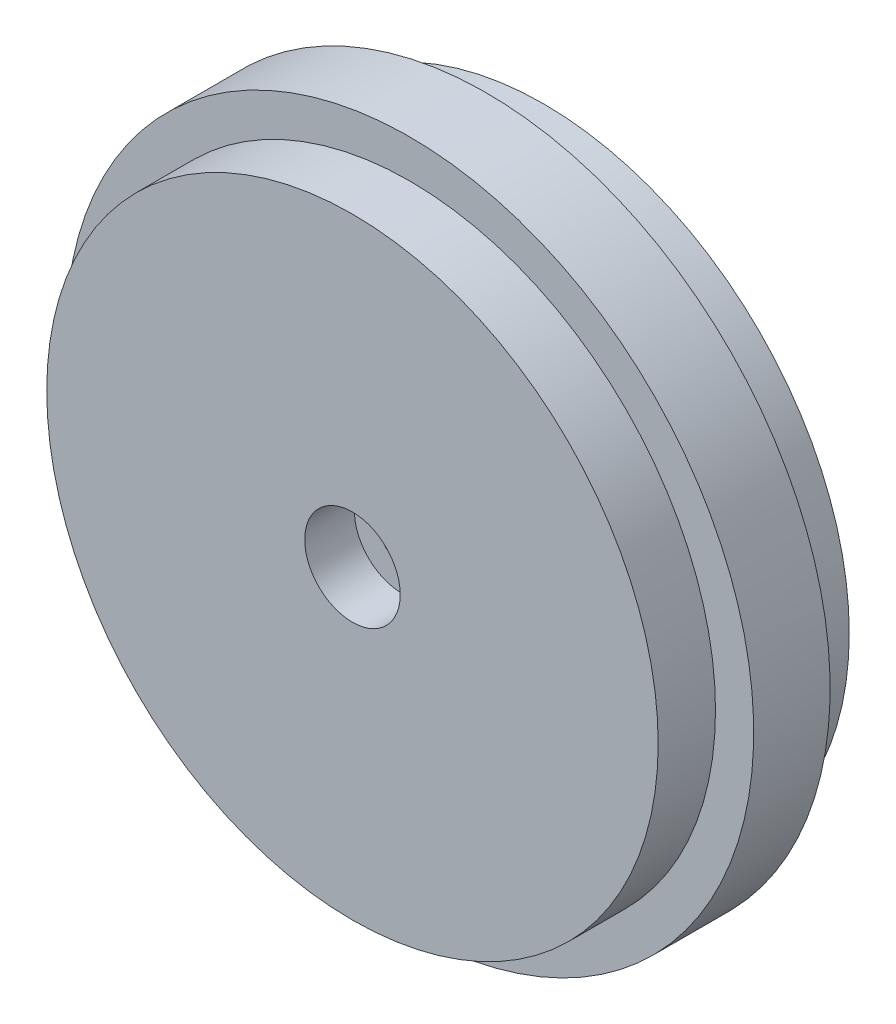
ISO-10303-21;
HEADER;
FILE_DESCRIPTION(('STEP AP214'),'2;1');
FILE_NAME('part.step','',(''),(''),'','','');
FILE_SCHEMA(('AUTOMOTIVE_DESIGN { 1 0 10303 214 1 1 1 1 }'));
ENDSEC;
DATA;
#1=APPLICATION_CONTEXT('core data for automotive mechanical design processes');
#2=APPLICATION_PROTOCOL_DEFINITION('international standard','automotive_design',2000,#1);
#3=PRODUCT_CONTEXT('',#1,'mechanical');
#4=PRODUCT('Part','Part','',(#3));
#5=PRODUCT_RELATED_PRODUCT_CATEGORY('part','',(#4));
#6=PRODUCT_DEFINITION_FORMATION('','',#4);
#7=PRODUCT_DEFINITION_CONTEXT('part definition',#1,'design');
#8=PRODUCT_DEFINITION('design','',#6,#7);
#9=PRODUCT_DEFINITION_SHAPE('','',#8);
#10=(LENGTH_UNIT() NAMED_UNIT(*) SI_UNIT(.MILLI.,.METRE.));
#11=(NAMED_UNIT(*) PLANE_ANGLE_UNIT() SI_UNIT($,.RADIAN.));
#12=(NAMED_UNIT(*) SI_UNIT($,.STERADIAN.) SOLID_ANGLE_UNIT());
#13=UNCERTAINTY_MEASURE_WITH_UNIT(LENGTH_MEASURE(1.E-05),#10,'distance_accuracy_value','');
#14=(GEOMETRIC_REPRESENTATION_CONTEXT(3) GLOBAL_UNCERTAINTY_ASSIGNED_CONTEXT((#13)) GLOBAL_UNIT_ASSIGNED_CONTEXT((#10,
#11,#12)) REPRESENTATION_CONTEXT('',''));
#15=CARTESIAN_POINT('',(0.,0.,0.));
#16=DIRECTION('',(0.,0.,1.));
#17=DIRECTION('',(1.,0.,0.));
#18=AXIS2_PLACEMENT_3D('',#15,#16,#17);
#19=CARTESIAN_POINT('',(0.,0.,20.));
#20=DIRECTION('',(0.,0.,-1.));
#21=DIRECTION('',(-1.,0.,0.));
#22=AXIS2_PLACEMENT_3D('',#19,#20,#21);
#23=CYLINDRICAL_SURFACE('',#22,16.);
#24=CARTESIAN_POINT('',(0.,0.,10.));
#25=DIRECTION('',(0.,0.,1.));
#26=DIRECTION('',(1.,0.,0.));
#27=AXIS2_PLACEMENT_3D('',#24,#25,#26);
#28=CIRCLE('',#27,16.);
#29=CARTESIAN_POINT('',(16.,0.,10.));
#30=VERTEX_POINT('',#29);
#31=EDGE_CURVE('E114',#30,#30,#28,.T.);
#32=ORIENTED_EDGE('',*,*,#31,.F.);
#33=EDGE_LOOP('',(#32));
#34=FACE_BOUND('',#33,.T.);
#35=CARTESIAN_POINT('',(0.,0.,7.));
#36=DIRECTION('',(0.,0.,-1.));
#37=DIRECTION('',(-1.,0.,0.));
#38=AXIS2_PLACEMENT_3D('',#35,#36,#37);
#39=CIRCLE('',#38,16.);
#40=CARTESIAN_POINT('',(-16.,0.,7.));
#41=VERTEX_POINT('',#40);
#42=EDGE_CURVE('E154',#41,#41,#39,.T.);
#43=ORIENTED_EDGE('',*,*,#42,.F.);
#44=EDGE_LOOP('',(#43));
#45=FACE_BOUND('',#44,.T.);
#46=ADVANCED_FACE('F41',(#34,#45),#23,.T.);
#47=CARTESIAN_POINT('',(0.,0.,0.));
#48=DIRECTION('',(0.,0.,1.));
#49=DIRECTION('',(1.,0.,0.));
#50=AXIS2_PLACEMENT_3D('',#47,#48,#49);
#51=PLANE('',#50);
#52=CARTESIAN_POINT('',(0.,0.,0.));
#53=DIRECTION('',(0.,0.,-1.));
#54=DIRECTION('',(-1.,0.,0.));
#55=AXIS2_PLACEMENT_3D('',#52,#53,#54);
#56=CIRCLE('',#55,13.5);
#57=CARTESIAN_POINT('',(-13.5,0.,0.));
#58=VERTEX_POINT('',#57);
#59=EDGE_CURVE('E123',#58,#58,#56,.T.);
#60=ORIENTED_EDGE('',*,*,#59,.F.);
#61=EDGE_LOOP('',(#60));
#62=FACE_BOUND('',#61,.T.);
#63=CARTESIAN_POINT('',(0.,0.,0.));
#64=DIRECTION('',(0.,0.,-1.));
#65=DIRECTION('',(-1.,0.,0.));
#66=AXIS2_PLACEMENT_3D('',#63,#64,#65);
#67=CIRCLE('',#66,16.);
#68=CARTESIAN_POINT('',(-16.,0.,0.));
#69=VERTEX_POINT('',#68);
#70=EDGE_CURVE('E142',#69,#69,#67,.T.);
#71=ORIENTED_EDGE('',*,*,#70,.T.);
#72=EDGE_LOOP('',(#71));
#73=FACE_BOUND('',#72,.T.);
#74=ADVANCED_FACE('F43',(#62,#73),#51,.F.);
#75=CARTESIAN_POINT('',(0.,0.,10.));
#76=DIRECTION('',(0.,0.,1.));
#77=DIRECTION('',(1.,0.,0.));
#78=AXIS2_PLACEMENT_3D('',#75,#76,#77);
#79=PLANE('',#78);
#80=ORIENTED_EDGE('',*,*,#31,.T.);
#81=EDGE_LOOP('',(#80));
#82=FACE_BOUND('',#81,.T.);
#83=CARTESIAN_POINT('',(0.,0.,10.));
#84=DIRECTION('',(0.,0.,1.));
#85=DIRECTION('',(1.,0.,0.));
#86=AXIS2_PLACEMENT_3D('',#83,#84,#85);
#87=CIRCLE('',#86,2.5);
#88=CARTESIAN_POINT('',(2.5,0.,10.));
#89=VERTEX_POINT('',#88);
#90=EDGE_CURVE('E158',#89,#89,#87,.T.);
#91=ORIENTED_EDGE('',*,*,#90,.F.);
#92=EDGE_LOOP('',(#91));
#93=FACE_BOUND('',#92,.T.);
#94=ADVANCED_FACE('F164',(#82,#93),#79,.T.);
#95=CARTESIAN_POINT('',(0.,0.,9.));
#96=DIRECTION('',(0.,0.,1.));
#97=DIRECTION('',(1.,0.,0.));
#98=AXIS2_PLACEMENT_3D('',#95,#96,#97);
#99=CYLINDRICAL_SURFACE('',#98,1.2);
#100=CARTESIAN_POINT('',(0.,0.,7.4));
#101=DIRECTION('',(0.,0.,1.));
#102=DIRECTION('',(1.,0.,0.));
#103=AXIS2_PLACEMENT_3D('',#100,#101,#102);
#104=CIRCLE('',#103,1.2);
#105=CARTESIAN_POINT('',(1.2,0.,7.4));
#106=VERTEX_POINT('',#105);
#107=EDGE_CURVE('E49',#106,#106,#104,.T.);
#108=ORIENTED_EDGE('',*,*,#107,.T.);
#109=EDGE_LOOP('',(#108));
#110=FACE_BOUND('',#109,.T.);
#111=CARTESIAN_POINT('',(0.,0.,7.));
#112=DIRECTION('',(0.,0.,-1.));
#113=DIRECTION('',(-1.,0.,0.));
#114=AXIS2_PLACEMENT_3D('',#111,#112,#113);
#115=CIRCLE('',#114,1.2);
#116=CARTESIAN_POINT('',(-1.2,0.,7.));
#117=VERTEX_POINT('',#116);
#118=EDGE_CURVE('E120',#117,#117,#115,.F.);
#119=ORIENTED_EDGE('',*,*,#118,.F.);
#120=EDGE_LOOP('',(#119));
#121=FACE_BOUND('',#120,.T.);
#122=ADVANCED_FACE('F166',(#110,#121),#99,.F.);
#123=DIRECTION('',(0.,-1.,0.));
#124=VECTOR('',#123,1.);
#125=CARTESIAN_POINT('',(2.15,2.09224759529077,0.));
#126=LINE('',#125,#124);
#127=CARTESIAN_POINT('',(2.15,2.09224759529077,0.));
#128=VERTEX_POINT('',#127);
#129=CARTESIAN_POINT('',(2.15,-2.09224759529077,0.));
#130=VERTEX_POINT('',#129);
#131=EDGE_CURVE('E91',#128,#130,#126,.T.);
#132=ORIENTED_EDGE('',*,*,#131,.F.);
#133=CARTESIAN_POINT('',(0.,0.,0.));
#134=DIRECTION('',(0.,0.,-1.));
#135=DIRECTION('',(-1.,0.,0.));
#136=AXIS2_PLACEMENT_3D('',#133,#134,#135);
#137=CIRCLE('',#136,3.);
#138=CARTESIAN_POINT('',(-2.15,2.09224759529077,0.));
#139=VERTEX_POINT('',#138);
#140=EDGE_CURVE('E56',#139,#128,#137,.T.);
#141=ORIENTED_EDGE('',*,*,#140,.F.);
#142=DIRECTION('',(0.,1.,0.));
#143=VECTOR('',#142,1.);
#144=CARTESIAN_POINT('',(-2.15,2.09224759529077,0.));
#145=LINE('',#144,#143);
#146=CARTESIAN_POINT('',(-2.15,-2.09224759529077,0.));
#147=VERTEX_POINT('',#146);
#148=EDGE_CURVE('E108',#147,#139,#145,.T.);
#149=ORIENTED_EDGE('',*,*,#148,.F.);
#150=CARTESIAN_POINT('',(0.,0.,0.));
#151=DIRECTION('',(0.,0.,-1.));
#152=DIRECTION('',(-1.,0.,0.));
#153=AXIS2_PLACEMENT_3D('',#150,#151,#152);
#154=CIRCLE('',#153,3.);
#155=EDGE_CURVE('E116',#130,#147,#154,.T.);
#156=ORIENTED_EDGE('',*,*,#155,.F.);
#157=EDGE_LOOP('',(#132,#141,#149,#156));
#158=FACE_BOUND('',#157,.T.);
#159=CARTESIAN_POINT('',(0.,0.,0.));
#160=DIRECTION('',(0.,0.,-1.));
#161=DIRECTION('',(-1.,0.,0.));
#162=AXIS2_PLACEMENT_3D('',#159,#160,#161);
#163=CIRCLE('',#162,4.2);
#164=CARTESIAN_POINT('',(-4.2,0.,0.));
#165=VERTEX_POINT('',#164);
#166=EDGE_CURVE('E127',#165,#165,#163,.T.);
#167=ORIENTED_EDGE('',*,*,#166,.T.);
#168=EDGE_LOOP('',(#167));
#169=FACE_BOUND('',#168,.T.);
#170=ADVANCED_FACE('F171',(#158,#169),#51,.F.);
#171=CARTESIAN_POINT('',(1.2,0.,7.4));
#172=DIRECTION('',(0.,0.,-1.));
#173=DIRECTION('',(-1.,0.,0.));
#174=AXIS2_PLACEMENT_3D('',#171,#172,#173);
#175=PLANE('',#174);
#176=ORIENTED_EDGE('',*,*,#107,.F.);
#177=EDGE_LOOP('',(#176));
#178=FACE_BOUND('',#177,.T.);
#179=CARTESIAN_POINT('',(0.,0.,7.4));
#180=DIRECTION('',(0.,0.,1.));
#181=DIRECTION('',(1.,0.,0.));
#182=AXIS2_PLACEMENT_3D('',#179,#180,#181);
#183=CIRCLE('',#182,2.5);
#184=CARTESIAN_POINT('',(2.5,0.,7.4));
#185=VERTEX_POINT('',#184);
#186=EDGE_CURVE('E133',#185,#185,#183,.T.);
#187=ORIENTED_EDGE('',*,*,#186,.T.);
#188=EDGE_LOOP('',(#187));
#189=FACE_BOUND('',#188,.T.);
#190=ADVANCED_FACE('F284',(#178,#189),#175,.F.);
#191=CARTESIAN_POINT('',(0.,0.,9.));
#192=DIRECTION('',(0.,0.,1.));
#193=DIRECTION('',(1.,0.,0.));
#194=AXIS2_PLACEMENT_3D('',#191,#192,#193);
#195=CYLINDRICAL_SURFACE('',#194,2.5);
#196=ORIENTED_EDGE('',*,*,#186,.F.);
#197=EDGE_LOOP('',(#196));
#198=FACE_BOUND('',#197,.T.);
#199=ORIENTED_EDGE('',*,*,#90,.T.);
#200=EDGE_LOOP('',(#199));
#201=FACE_BOUND('',#200,.T.);
#202=ADVANCED_FACE('F162',(#198,#201),#195,.F.);
#203=CARTESIAN_POINT('',(0.,0.,47.1837661840736));
#204=DIRECTION('',(0.,0.,-1.));
#205=DIRECTION('',(-1.,0.,0.));
#206=AXIS2_PLACEMENT_3D('',#203,#204,#205);
#207=CYLINDRICAL_SURFACE('',#206,13.5);
#208=ORIENTED_EDGE('',*,*,#59,.T.);
#209=EDGE_LOOP('',(#208));
#210=FACE_BOUND('',#209,.T.);
#211=CARTESIAN_POINT('',(0.,0.,7.));
#212=DIRECTION('',(0.,0.,1.));
#213=DIRECTION('',(1.,0.,0.));
#214=AXIS2_PLACEMENT_3D('',#211,#212,#213);
#215=CIRCLE('',#214,13.5);
#216=CARTESIAN_POINT('',(13.5,0.,7.));
#217=VERTEX_POINT('',#216);
#218=EDGE_CURVE('E130',#217,#217,#215,.F.);
#219=ORIENTED_EDGE('',*,*,#218,.F.);
#220=EDGE_LOOP('',(#219));
#221=FACE_BOUND('',#220,.T.);
#222=ADVANCED_FACE('F310',(#210,#221),#207,.F.);
#223=CARTESIAN_POINT('',(0.,0.,47.1837661840736));
#224=DIRECTION('',(0.,0.,-1.));
#225=DIRECTION('',(-1.,0.,0.));
#226=AXIS2_PLACEMENT_3D('',#223,#224,#225);
#227=CYLINDRICAL_SURFACE('',#226,4.2);
#228=ORIENTED_EDGE('',*,*,#166,.F.);
#229=EDGE_LOOP('',(#228));
#230=FACE_BOUND('',#229,.T.);
#231=CARTESIAN_POINT('',(0.,0.,7.));
#232=DIRECTION('',(0.,0.,1.));
#233=DIRECTION('',(1.,0.,0.));
#234=AXIS2_PLACEMENT_3D('',#231,#232,#233);
#235=CIRCLE('',#234,4.2);
#236=CARTESIAN_POINT('',(4.2,0.,7.));
#237=VERTEX_POINT('',#236);
#238=EDGE_CURVE('E126',#237,#237,#235,.F.);
#239=ORIENTED_EDGE('',*,*,#238,.T.);
#240=EDGE_LOOP('',(#239));
#241=FACE_BOUND('',#240,.T.);
#242=ADVANCED_FACE('F300',(#230,#241),#227,.T.);
#243=CARTESIAN_POINT('',(0.,0.,7.));
#244=DIRECTION('',(0.,0.,1.));
#245=DIRECTION('',(1.,0.,0.));
#246=AXIS2_PLACEMENT_3D('',#243,#244,#245);
#247=PLANE('',#246);
#248=ORIENTED_EDGE('',*,*,#218,.T.);
#249=EDGE_LOOP('',(#248));
#250=FACE_BOUND('',#249,.T.);
#251=ORIENTED_EDGE('',*,*,#238,.F.);
#252=EDGE_LOOP('',(#251));
#253=FACE_BOUND('',#252,.T.);
#254=ADVANCED_FACE('F274',(#250,#253),#247,.F.);
#255=CARTESIAN_POINT('',(0.,0.,7.));
#256=DIRECTION('',(0.,0.,-1.));
#257=DIRECTION('',(-1.,0.,0.));
#258=AXIS2_PLACEMENT_3D('',#255,#256,#257);
#259=PLANE('',#258);
#260=CARTESIAN_POINT('',(0.,0.,7.));
#261=DIRECTION('',(0.,0.,-1.));
#262=DIRECTION('',(-1.,0.,0.));
#263=AXIS2_PLACEMENT_3D('',#260,#261,#262);
#264=CIRCLE('',#263,3.);
#265=CARTESIAN_POINT('',(-2.15,2.09224759529077,7.));
#266=VERTEX_POINT('',#265);
#267=CARTESIAN_POINT('',(2.15,2.09224759529077,7.));
#268=VERTEX_POINT('',#267);
#269=EDGE_CURVE('E106',#266,#268,#264,.T.);
#270=ORIENTED_EDGE('',*,*,#269,.T.);
#271=DIRECTION('',(0.,-1.,0.));
#272=VECTOR('',#271,1.);
#273=CARTESIAN_POINT('',(2.15,2.09224759529077,7.));
#274=LINE('',#273,#272);
#275=CARTESIAN_POINT('',(2.15,-2.09224759529077,7.));
#276=VERTEX_POINT('',#275);
#277=EDGE_CURVE('E88',#268,#276,#274,.T.);
#278=ORIENTED_EDGE('',*,*,#277,.T.);
#279=CARTESIAN_POINT('',(0.,0.,7.));
#280=DIRECTION('',(0.,0.,-1.));
#281=DIRECTION('',(-1.,0.,0.));
#282=AXIS2_PLACEMENT_3D('',#279,#280,#281);
#283=CIRCLE('',#282,3.);
#284=CARTESIAN_POINT('',(-2.15,-2.09224759529077,7.));
#285=VERTEX_POINT('',#284);
#286=EDGE_CURVE('E98',#276,#285,#283,.T.);
#287=ORIENTED_EDGE('',*,*,#286,.T.);
#288=DIRECTION('',(0.,1.,0.));
#289=VECTOR('',#288,1.);
#290=CARTESIAN_POINT('',(-2.15,2.09224759529077,7.));
#291=LINE('',#290,#289);
#292=EDGE_CURVE('E102',#285,#266,#291,.T.);
#293=ORIENTED_EDGE('',*,*,#292,.T.);
#294=EDGE_LOOP('',(#270,#278,#287,#293));
#295=FACE_BOUND('',#294,.T.);
#296=ORIENTED_EDGE('',*,*,#118,.T.);
#297=EDGE_LOOP('',(#296));
#298=FACE_BOUND('',#297,.T.);
#299=ADVANCED_FACE('F104',(#295,#298),#259,.T.);
#300=CARTESIAN_POINT('',(0.,0.,7.));
#301=DIRECTION('',(0.,0.,-1.));
#302=DIRECTION('',(-1.,0.,0.));
#303=AXIS2_PLACEMENT_3D('',#300,#301,#302);
#304=CYLINDRICAL_SURFACE('',#303,3.);
#305=ORIENTED_EDGE('',*,*,#140,.T.);
#306=DIRECTION('',(0.,0.,-1.));
#307=VECTOR('',#306,1.);
#308=CARTESIAN_POINT('',(2.15,2.09224759529077,7.));
#309=LINE('',#308,#307);
#310=EDGE_CURVE('E79',#268,#128,#309,.T.);
#311=ORIENTED_EDGE('',*,*,#310,.F.);
#312=ORIENTED_EDGE('',*,*,#269,.F.);
#313=DIRECTION('',(0.,0.,-1.));
#314=VECTOR('',#313,1.);
#315=CARTESIAN_POINT('',(-2.15,2.09224759529077,7.));
#316=LINE('',#315,#314);
#317=EDGE_CURVE('E64',#266,#139,#316,.T.);
#318=ORIENTED_EDGE('',*,*,#317,.T.);
#319=EDGE_LOOP('',(#305,#311,#312,#318));
#320=FACE_BOUND('',#319,.T.);
#321=ADVANCED_FACE('F257',(#320),#304,.F.);
#322=CARTESIAN_POINT('',(-2.15,2.09224759529077,7.));
#323=DIRECTION('',(-1.,0.,0.));
#324=DIRECTION('',(0.,0.,1.));
#325=AXIS2_PLACEMENT_3D('',#322,#323,#324);
#326=PLANE('',#325);
#327=ORIENTED_EDGE('',*,*,#148,.T.);
#328=ORIENTED_EDGE('',*,*,#317,.F.);
#329=ORIENTED_EDGE('',*,*,#292,.F.);
#330=DIRECTION('',(0.,0.,-1.));
#331=VECTOR('',#330,1.);
#332=CARTESIAN_POINT('',(-2.15,-2.09224759529077,7.));
#333=LINE('',#332,#331);
#334=EDGE_CURVE('E95',#285,#147,#333,.T.);
#335=ORIENTED_EDGE('',*,*,#334,.T.);
#336=EDGE_LOOP('',(#327,#328,#329,#335));
#337=FACE_BOUND('',#336,.T.);
#338=ADVANCED_FACE('F248',(#337),#326,.F.);
#339=CARTESIAN_POINT('',(0.,0.,7.));
#340=DIRECTION('',(0.,0.,-1.));
#341=DIRECTION('',(-1.,0.,0.));
#342=AXIS2_PLACEMENT_3D('',#339,#340,#341);
#343=CYLINDRICAL_SURFACE('',#342,3.);
#344=ORIENTED_EDGE('',*,*,#155,.T.);
#345=ORIENTED_EDGE('',*,*,#334,.F.);
#346=ORIENTED_EDGE('',*,*,#286,.F.);
#347=DIRECTION('',(0.,0.,-1.));
#348=VECTOR('',#347,1.);
#349=CARTESIAN_POINT('',(2.15,-2.09224759529077,7.));
#350=LINE('',#349,#348);
#351=EDGE_CURVE('E84',#276,#130,#350,.T.);
#352=ORIENTED_EDGE('',*,*,#351,.T.);
#353=EDGE_LOOP('',(#344,#345,#346,#352));
#354=FACE_BOUND('',#353,.T.);
#355=ADVANCED_FACE('F99',(#354),#343,.F.);
#356=CARTESIAN_POINT('',(2.15,2.09224759529077,7.));
#357=DIRECTION('',(1.,0.,0.));
#358=DIRECTION('',(0.,0.,-1.));
#359=AXIS2_PLACEMENT_3D('',#356,#357,#358);
#360=PLANE('',#359);
#361=ORIENTED_EDGE('',*,*,#131,.T.);
#362=ORIENTED_EDGE('',*,*,#351,.F.);
#363=ORIENTED_EDGE('',*,*,#277,.F.);
#364=ORIENTED_EDGE('',*,*,#310,.T.);
#365=EDGE_LOOP('',(#361,#362,#363,#364));
#366=FACE_BOUND('',#365,.T.);
#367=ADVANCED_FACE('F86',(#366),#360,.F.);
#368=CARTESIAN_POINT('',(0.,0.,3.));
#369=DIRECTION('',(0.,0.,-1.));
#370=DIRECTION('',(-1.,0.,0.));
#371=AXIS2_PLACEMENT_3D('',#368,#369,#370);
#372=CIRCLE('',#371,16.);
#373=CARTESIAN_POINT('',(-16.,0.,3.));
#374=VERTEX_POINT('',#373);
#375=EDGE_CURVE('E12',#374,#374,#372,.F.);
#376=ORIENTED_EDGE('',*,*,#375,.F.);
#377=EDGE_LOOP('',(#376));
#378=FACE_BOUND('',#377,.T.);
#379=ORIENTED_EDGE('',*,*,#70,.F.);
#380=EDGE_LOOP('',(#379));
#381=FACE_BOUND('',#380,.T.);
#382=ADVANCED_FACE('F178',(#378,#381),#23,.T.);
#383=CARTESIAN_POINT('',(0.,0.,7.));
#384=DIRECTION('',(0.,0.,-1.));
#385=DIRECTION('',(-1.,0.,0.));
#386=AXIS2_PLACEMENT_3D('',#383,#384,#385);
#387=CYLINDRICAL_SURFACE('',#386,18.);
#388=CARTESIAN_POINT('',(0.,0.,7.));
#389=DIRECTION('',(0.,0.,-1.));
#390=DIRECTION('',(-1.,0.,0.));
#391=AXIS2_PLACEMENT_3D('',#388,#389,#390);
#392=CIRCLE('',#391,18.);
#393=CARTESIAN_POINT('',(-18.,0.,7.));
#394=VERTEX_POINT('',#393);
#395=EDGE_CURVE('E146',#394,#394,#392,.T.);
#396=ORIENTED_EDGE('',*,*,#395,.T.);
#397=EDGE_LOOP('',(#396));
#398=FACE_BOUND('',#397,.T.);
#399=CARTESIAN_POINT('',(0.,0.,3.));
#400=DIRECTION('',(0.,0.,-1.));
#401=DIRECTION('',(-1.,0.,0.));
#402=AXIS2_PLACEMENT_3D('',#399,#400,#401);
#403=CIRCLE('',#402,18.);
#404=CARTESIAN_POINT('',(-18.,0.,3.));
#405=VERTEX_POINT('',#404);
#406=EDGE_CURVE('E150',#405,#405,#403,.T.);
#407=ORIENTED_EDGE('',*,*,#406,.F.);
#408=EDGE_LOOP('',(#407));
#409=FACE_BOUND('',#408,.T.);
#410=ADVANCED_FACE('F185',(#398,#409),#387,.T.);
#411=CARTESIAN_POINT('',(0.,0.,7.));
#412=DIRECTION('',(0.,0.,-1.));
#413=DIRECTION('',(-1.,0.,0.));
#414=AXIS2_PLACEMENT_3D('',#411,#412,#413);
#415=PLANE('',#414);
#416=ORIENTED_EDGE('',*,*,#42,.T.);
#417=EDGE_LOOP('',(#416));
#418=FACE_BOUND('',#417,.T.);
#419=ORIENTED_EDGE('',*,*,#395,.F.);
#420=EDGE_LOOP('',(#419));
#421=FACE_BOUND('',#420,.T.);
#422=ADVANCED_FACE('F191',(#418,#421),#415,.F.);
#423=CARTESIAN_POINT('',(0.,0.,3.));
#424=DIRECTION('',(0.,0.,-1.));
#425=DIRECTION('',(-1.,0.,0.));
#426=AXIS2_PLACEMENT_3D('',#423,#424,#425);
#427=PLANE('',#426);
#428=ORIENTED_EDGE('',*,*,#375,.T.);
#429=EDGE_LOOP('',(#428));
#430=FACE_BOUND('',#429,.T.);
#431=ORIENTED_EDGE('',*,*,#406,.T.);
#432=EDGE_LOOP('',(#431));
#433=FACE_BOUND('',#432,.T.);
#434=ADVANCED_FACE('F197',(#430,#433),#427,.T.);
#435=CLOSED_SHELL('',(#46,#74,#94,#122,#170,#190,#202,#222,#242,#254,#299,#321,#338,#355,#367,
#382,#410,#422,#434));
#436=MANIFOLD_SOLID_BREP('B2',#435);
#437=ADVANCED_BREP_SHAPE_REPRESENTATION('',(#18,#436),#14);
#438=SHAPE_DEFINITION_REPRESENTATION(#9,#437);
ENDSEC;
END-ISO-10303-21;
